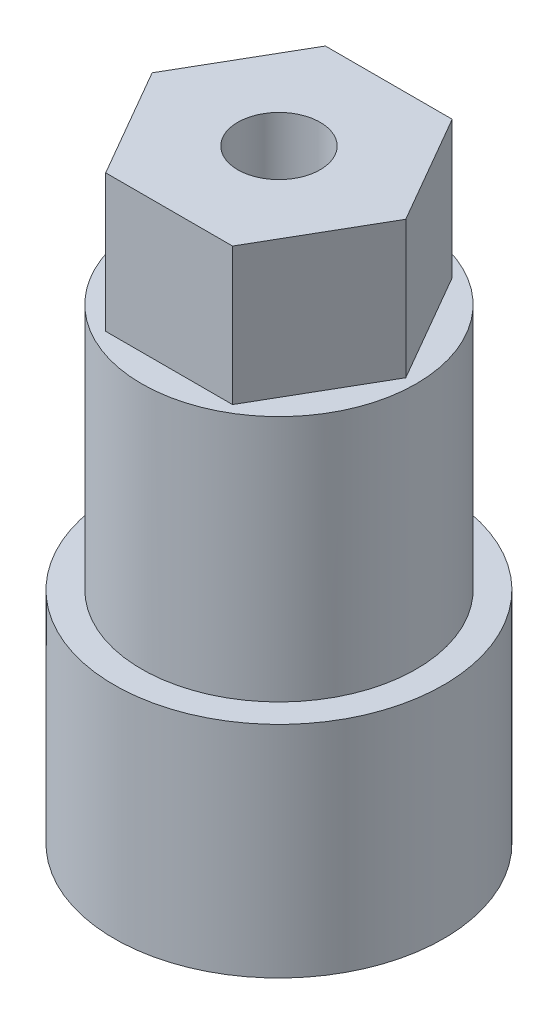
ISO-10303-21;
HEADER;
FILE_DESCRIPTION(('STEP AP214'),'2;1');
FILE_NAME('part.step','',(''),(''),'','','');
FILE_SCHEMA(('AUTOMOTIVE_DESIGN { 1 0 10303 214 1 1 1 1 }'));
ENDSEC;
DATA;
#1=APPLICATION_CONTEXT('core data for automotive mechanical design processes');
#2=APPLICATION_PROTOCOL_DEFINITION('international standard','automotive_design',2000,#1);
#3=PRODUCT_CONTEXT('',#1,'mechanical');
#4=PRODUCT('Part','Part','',(#3));
#5=PRODUCT_RELATED_PRODUCT_CATEGORY('part','',(#4));
#6=PRODUCT_DEFINITION_FORMATION('','',#4);
#7=PRODUCT_DEFINITION_CONTEXT('part definition',#1,'design');
#8=PRODUCT_DEFINITION('design','',#6,#7);
#9=PRODUCT_DEFINITION_SHAPE('','',#8);
#10=(LENGTH_UNIT() NAMED_UNIT(*) SI_UNIT(.MILLI.,.METRE.));
#11=(NAMED_UNIT(*) PLANE_ANGLE_UNIT() SI_UNIT($,.RADIAN.));
#12=(NAMED_UNIT(*) SI_UNIT($,.STERADIAN.) SOLID_ANGLE_UNIT());
#13=UNCERTAINTY_MEASURE_WITH_UNIT(LENGTH_MEASURE(1.E-05),#10,'distance_accuracy_value','');
#14=(GEOMETRIC_REPRESENTATION_CONTEXT(3) GLOBAL_UNCERTAINTY_ASSIGNED_CONTEXT((#13)) GLOBAL_UNIT_ASSIGNED_CONTEXT((#10,
#11,#12)) REPRESENTATION_CONTEXT('',''));
#15=CARTESIAN_POINT('',(0.,0.,0.));
#16=DIRECTION('',(0.,0.,1.));
#17=DIRECTION('',(1.,0.,0.));
#18=AXIS2_PLACEMENT_3D('',#15,#16,#17);
#19=CARTESIAN_POINT('',(0.,9.,0.));
#20=DIRECTION('',(0.,1.,0.));
#21=DIRECTION('',(0.,0.,1.));
#22=AXIS2_PLACEMENT_3D('',#19,#20,#21);
#23=PLANE('',#22);
#24=CARTESIAN_POINT('',(0.,9.,0.));
#25=DIRECTION('',(0.,1.,0.));
#26=DIRECTION('',(0.,0.,1.));
#27=AXIS2_PLACEMENT_3D('',#24,#25,#26);
#28=CIRCLE('',#27,5.);
#29=CARTESIAN_POINT('',(0.,9.,5.));
#30=VERTEX_POINT('',#29);
#31=EDGE_CURVE('E11',#30,#30,#28,.T.);
#32=ORIENTED_EDGE('',*,*,#31,.T.);
#33=EDGE_LOOP('',(#32));
#34=FACE_BOUND('',#33,.T.);
#35=DIRECTION('',(-0.5,0.,-0.866025403784439));
#36=VECTOR('',#35,1.);
#37=CARTESIAN_POINT('',(4.61880215351701,9.,0.));
#38=LINE('',#37,#36);
#39=CARTESIAN_POINT('',(4.61880215351701,9.,0.));
#40=VERTEX_POINT('',#39);
#41=CARTESIAN_POINT('',(2.3094010767585,9.,-4.));
#42=VERTEX_POINT('',#41);
#43=EDGE_CURVE('E122',#40,#42,#38,.T.);
#44=ORIENTED_EDGE('',*,*,#43,.F.);
#45=DIRECTION('',(0.5,0.,-0.866025403784439));
#46=VECTOR('',#45,1.);
#47=CARTESIAN_POINT('',(2.3094010767585,9.,4.));
#48=LINE('',#47,#46);
#49=CARTESIAN_POINT('',(2.3094010767585,9.,4.));
#50=VERTEX_POINT('',#49);
#51=EDGE_CURVE('E119',#50,#40,#48,.T.);
#52=ORIENTED_EDGE('',*,*,#51,.F.);
#53=DIRECTION('',(1.,0.,0.));
#54=VECTOR('',#53,1.);
#55=CARTESIAN_POINT('',(-2.3094010767585,9.,4.));
#56=LINE('',#55,#54);
#57=CARTESIAN_POINT('',(-2.3094010767585,9.,4.));
#58=VERTEX_POINT('',#57);
#59=EDGE_CURVE('E78',#58,#50,#56,.T.);
#60=ORIENTED_EDGE('',*,*,#59,.F.);
#61=DIRECTION('',(0.5,0.,0.866025403784439));
#62=VECTOR('',#61,1.);
#63=CARTESIAN_POINT('',(-4.61880215351701,9.,0.));
#64=LINE('',#63,#62);
#65=CARTESIAN_POINT('',(-4.61880215351701,9.,0.));
#66=VERTEX_POINT('',#65);
#67=EDGE_CURVE('E128',#66,#58,#64,.T.);
#68=ORIENTED_EDGE('',*,*,#67,.F.);
#69=DIRECTION('',(-0.5,0.,0.866025403784439));
#70=VECTOR('',#69,1.);
#71=CARTESIAN_POINT('',(-2.3094010767585,9.,-4.));
#72=LINE('',#71,#70);
#73=CARTESIAN_POINT('',(-2.3094010767585,9.,-4.));
#74=VERTEX_POINT('',#73);
#75=EDGE_CURVE('E108',#74,#66,#72,.T.);
#76=ORIENTED_EDGE('',*,*,#75,.F.);
#77=DIRECTION('',(-1.,0.,0.));
#78=VECTOR('',#77,1.);
#79=CARTESIAN_POINT('',(2.3094010767585,9.,-4.));
#80=LINE('',#79,#78);
#81=EDGE_CURVE('E125',#42,#74,#80,.T.);
#82=ORIENTED_EDGE('',*,*,#81,.F.);
#83=EDGE_LOOP('',(#44,#52,#60,#68,#76,#82));
#84=FACE_BOUND('',#83,.T.);
#85=ADVANCED_FACE('F35',(#34,#84),#23,.T.);
#86=CARTESIAN_POINT('',(0.,9.,0.));
#87=DIRECTION('',(0.,-1.,0.));
#88=DIRECTION('',(0.,0.,-1.));
#89=AXIS2_PLACEMENT_3D('',#86,#87,#88);
#90=CYLINDRICAL_SURFACE('',#89,5.);
#91=ORIENTED_EDGE('',*,*,#31,.F.);
#92=EDGE_LOOP('',(#91));
#93=FACE_BOUND('',#92,.T.);
#94=CARTESIAN_POINT('',(0.,0.,0.));
#95=DIRECTION('',(0.,-1.,0.));
#96=DIRECTION('',(0.,0.,-1.));
#97=AXIS2_PLACEMENT_3D('',#94,#95,#96);
#98=CIRCLE('',#97,5.);
#99=CARTESIAN_POINT('',(0.,0.,-5.));
#100=VERTEX_POINT('',#99);
#101=EDGE_CURVE('E43',#100,#100,#98,.T.);
#102=ORIENTED_EDGE('',*,*,#101,.F.);
#103=EDGE_LOOP('',(#102));
#104=FACE_BOUND('',#103,.T.);
#105=ADVANCED_FACE('F37',(#93,#104),#90,.T.);
#106=CARTESIAN_POINT('',(0.,0.,0.));
#107=DIRECTION('',(0.,-1.,0.));
#108=DIRECTION('',(0.,0.,-1.));
#109=AXIS2_PLACEMENT_3D('',#106,#107,#108);
#110=PLANE('',#109);
#111=CARTESIAN_POINT('',(0.,0.,0.));
#112=DIRECTION('',(0.,-1.,0.));
#113=DIRECTION('',(0.,0.,-1.));
#114=AXIS2_PLACEMENT_3D('',#111,#112,#113);
#115=CIRCLE('',#114,6.);
#116=CARTESIAN_POINT('',(0.,0.,-6.));
#117=VERTEX_POINT('',#116);
#118=EDGE_CURVE('E140',#117,#117,#115,.T.);
#119=ORIENTED_EDGE('',*,*,#118,.F.);
#120=EDGE_LOOP('',(#119));
#121=FACE_BOUND('',#120,.T.);
#122=ORIENTED_EDGE('',*,*,#101,.T.);
#123=EDGE_LOOP('',(#122));
#124=FACE_BOUND('',#123,.T.);
#125=ADVANCED_FACE('F148',(#121,#124),#110,.F.);
#126=CARTESIAN_POINT('',(0.,-8.,0.));
#127=DIRECTION('',(0.,1.,0.));
#128=DIRECTION('',(0.,0.,1.));
#129=AXIS2_PLACEMENT_3D('',#126,#127,#128);
#130=CYLINDRICAL_SURFACE('',#129,6.);
#131=CARTESIAN_POINT('',(0.,-8.,0.));
#132=DIRECTION('',(0.,-1.,0.));
#133=DIRECTION('',(0.,0.,-1.));
#134=AXIS2_PLACEMENT_3D('',#131,#132,#133);
#135=CIRCLE('',#134,6.);
#136=CARTESIAN_POINT('',(0.,-8.,-6.));
#137=VERTEX_POINT('',#136);
#138=EDGE_CURVE('E141',#137,#137,#135,.T.);
#139=ORIENTED_EDGE('',*,*,#138,.F.);
#140=EDGE_LOOP('',(#139));
#141=FACE_BOUND('',#140,.T.);
#142=ORIENTED_EDGE('',*,*,#118,.T.);
#143=EDGE_LOOP('',(#142));
#144=FACE_BOUND('',#143,.T.);
#145=ADVANCED_FACE('F156',(#141,#144),#130,.T.);
#146=CARTESIAN_POINT('',(0.,-8.,0.));
#147=DIRECTION('',(0.,-1.,0.));
#148=DIRECTION('',(0.,0.,-1.));
#149=AXIS2_PLACEMENT_3D('',#146,#147,#148);
#150=PLANE('',#149);
#151=ORIENTED_EDGE('',*,*,#138,.T.);
#152=EDGE_LOOP('',(#151));
#153=FACE_BOUND('',#152,.T.);
#154=ADVANCED_FACE('F206',(#153),#150,.T.);
#155=CARTESIAN_POINT('',(2.3094010767585,14.,4.));
#156=DIRECTION('',(-0.866025403784439,0.,-0.5));
#157=DIRECTION('',(-0.5,0.,0.866025403784439));
#158=AXIS2_PLACEMENT_3D('',#155,#156,#157);
#159=PLANE('',#158);
#160=ORIENTED_EDGE('',*,*,#51,.T.);
#161=DIRECTION('',(0.,-1.,0.));
#162=VECTOR('',#161,1.);
#163=CARTESIAN_POINT('',(4.61880215351701,14.,0.));
#164=LINE('',#163,#162);
#165=CARTESIAN_POINT('',(4.61880215351701,14.,0.));
#166=VERTEX_POINT('',#165);
#167=EDGE_CURVE('E138',#166,#40,#164,.T.);
#168=ORIENTED_EDGE('',*,*,#167,.F.);
#169=DIRECTION('',(0.5,0.,-0.866025403784439));
#170=VECTOR('',#169,1.);
#171=CARTESIAN_POINT('',(2.3094010767585,14.,4.));
#172=LINE('',#171,#170);
#173=CARTESIAN_POINT('',(2.3094010767585,14.,4.));
#174=VERTEX_POINT('',#173);
#175=EDGE_CURVE('E131',#174,#166,#172,.T.);
#176=ORIENTED_EDGE('',*,*,#175,.F.);
#177=DIRECTION('',(0.,-1.,0.));
#178=VECTOR('',#177,1.);
#179=CARTESIAN_POINT('',(2.3094010767585,14.,4.));
#180=LINE('',#179,#178);
#181=EDGE_CURVE('E115',#174,#50,#180,.T.);
#182=ORIENTED_EDGE('',*,*,#181,.T.);
#183=EDGE_LOOP('',(#160,#168,#176,#182));
#184=FACE_BOUND('',#183,.T.);
#185=ADVANCED_FACE('F203',(#184),#159,.F.);
#186=CARTESIAN_POINT('',(4.61880215351701,14.,0.));
#187=DIRECTION('',(-0.866025403784439,0.,0.5));
#188=DIRECTION('',(0.5,0.,0.866025403784439));
#189=AXIS2_PLACEMENT_3D('',#186,#187,#188);
#190=PLANE('',#189);
#191=ORIENTED_EDGE('',*,*,#43,.T.);
#192=DIRECTION('',(0.,-1.,0.));
#193=VECTOR('',#192,1.);
#194=CARTESIAN_POINT('',(2.3094010767585,14.,-4.));
#195=LINE('',#194,#193);
#196=CARTESIAN_POINT('',(2.3094010767585,14.,-4.));
#197=VERTEX_POINT('',#196);
#198=EDGE_CURVE('E135',#197,#42,#195,.T.);
#199=ORIENTED_EDGE('',*,*,#198,.F.);
#200=DIRECTION('',(-0.5,0.,-0.866025403784439));
#201=VECTOR('',#200,1.);
#202=CARTESIAN_POINT('',(4.61880215351701,14.,0.));
#203=LINE('',#202,#201);
#204=EDGE_CURVE('E86',#166,#197,#203,.T.);
#205=ORIENTED_EDGE('',*,*,#204,.F.);
#206=ORIENTED_EDGE('',*,*,#167,.T.);
#207=EDGE_LOOP('',(#191,#199,#205,#206));
#208=FACE_BOUND('',#207,.T.);
#209=ADVANCED_FACE('F165',(#208),#190,.F.);
#210=CARTESIAN_POINT('',(2.3094010767585,14.,-4.));
#211=DIRECTION('',(0.,0.,1.));
#212=DIRECTION('',(1.,0.,0.));
#213=AXIS2_PLACEMENT_3D('',#210,#211,#212);
#214=PLANE('',#213);
#215=ORIENTED_EDGE('',*,*,#81,.T.);
#216=DIRECTION('',(0.,-1.,0.));
#217=VECTOR('',#216,1.);
#218=CARTESIAN_POINT('',(-2.3094010767585,14.,-4.));
#219=LINE('',#218,#217);
#220=CARTESIAN_POINT('',(-2.3094010767585,14.,-4.));
#221=VERTEX_POINT('',#220);
#222=EDGE_CURVE('E111',#221,#74,#219,.T.);
#223=ORIENTED_EDGE('',*,*,#222,.F.);
#224=DIRECTION('',(-1.,0.,0.));
#225=VECTOR('',#224,1.);
#226=CARTESIAN_POINT('',(2.3094010767585,14.,-4.));
#227=LINE('',#226,#225);
#228=EDGE_CURVE('E99',#197,#221,#227,.T.);
#229=ORIENTED_EDGE('',*,*,#228,.F.);
#230=ORIENTED_EDGE('',*,*,#198,.T.);
#231=EDGE_LOOP('',(#215,#223,#229,#230));
#232=FACE_BOUND('',#231,.T.);
#233=ADVANCED_FACE('F168',(#232),#214,.F.);
#234=CARTESIAN_POINT('',(-2.3094010767585,14.,-4.));
#235=DIRECTION('',(0.866025403784439,0.,0.5));
#236=DIRECTION('',(0.5,0.,-0.866025403784439));
#237=AXIS2_PLACEMENT_3D('',#234,#235,#236);
#238=PLANE('',#237);
#239=ORIENTED_EDGE('',*,*,#75,.T.);
#240=DIRECTION('',(0.,-1.,0.));
#241=VECTOR('',#240,1.);
#242=CARTESIAN_POINT('',(-4.61880215351701,14.,0.));
#243=LINE('',#242,#241);
#244=CARTESIAN_POINT('',(-4.61880215351701,14.,0.));
#245=VERTEX_POINT('',#244);
#246=EDGE_CURVE('E105',#245,#66,#243,.T.);
#247=ORIENTED_EDGE('',*,*,#246,.F.);
#248=DIRECTION('',(-0.5,0.,0.866025403784439));
#249=VECTOR('',#248,1.);
#250=CARTESIAN_POINT('',(-2.3094010767585,14.,-4.));
#251=LINE('',#250,#249);
#252=EDGE_CURVE('E93',#221,#245,#251,.T.);
#253=ORIENTED_EDGE('',*,*,#252,.F.);
#254=ORIENTED_EDGE('',*,*,#222,.T.);
#255=EDGE_LOOP('',(#239,#247,#253,#254));
#256=FACE_BOUND('',#255,.T.);
#257=ADVANCED_FACE('F106',(#256),#238,.F.);
#258=CARTESIAN_POINT('',(-4.61880215351701,14.,0.));
#259=DIRECTION('',(0.866025403784439,0.,-0.5));
#260=DIRECTION('',(-0.5,0.,-0.866025403784439));
#261=AXIS2_PLACEMENT_3D('',#258,#259,#260);
#262=PLANE('',#261);
#263=ORIENTED_EDGE('',*,*,#67,.T.);
#264=DIRECTION('',(0.,-1.,0.));
#265=VECTOR('',#264,1.);
#266=CARTESIAN_POINT('',(-2.3094010767585,14.,4.));
#267=LINE('',#266,#265);
#268=CARTESIAN_POINT('',(-2.3094010767585,14.,4.));
#269=VERTEX_POINT('',#268);
#270=EDGE_CURVE('E50',#269,#58,#267,.T.);
#271=ORIENTED_EDGE('',*,*,#270,.F.);
#272=DIRECTION('',(0.5,0.,0.866025403784439));
#273=VECTOR('',#272,1.);
#274=CARTESIAN_POINT('',(-4.61880215351701,14.,0.));
#275=LINE('',#274,#273);
#276=EDGE_CURVE('E97',#245,#269,#275,.T.);
#277=ORIENTED_EDGE('',*,*,#276,.F.);
#278=ORIENTED_EDGE('',*,*,#246,.T.);
#279=EDGE_LOOP('',(#263,#271,#277,#278));
#280=FACE_BOUND('',#279,.T.);
#281=ADVANCED_FACE('F113',(#280),#262,.F.);
#282=CARTESIAN_POINT('',(-2.3094010767585,14.,4.));
#283=DIRECTION('',(0.,0.,-1.));
#284=DIRECTION('',(-1.,0.,0.));
#285=AXIS2_PLACEMENT_3D('',#282,#283,#284);
#286=PLANE('',#285);
#287=ORIENTED_EDGE('',*,*,#59,.T.);
#288=ORIENTED_EDGE('',*,*,#181,.F.);
#289=DIRECTION('',(1.,0.,0.));
#290=VECTOR('',#289,1.);
#291=CARTESIAN_POINT('',(-2.3094010767585,14.,4.));
#292=LINE('',#291,#290);
#293=EDGE_CURVE('E58',#269,#174,#292,.T.);
#294=ORIENTED_EDGE('',*,*,#293,.F.);
#295=ORIENTED_EDGE('',*,*,#270,.T.);
#296=EDGE_LOOP('',(#287,#288,#294,#295));
#297=FACE_BOUND('',#296,.T.);
#298=ADVANCED_FACE('F187',(#297),#286,.F.);
#299=CARTESIAN_POINT('',(0.,14.,0.));
#300=DIRECTION('',(0.,1.,0.));
#301=DIRECTION('',(0.,0.,1.));
#302=AXIS2_PLACEMENT_3D('',#299,#300,#301);
#303=PLANE('',#302);
#304=CARTESIAN_POINT('',(0.,14.,0.));
#305=DIRECTION('',(0.,1.,0.));
#306=DIRECTION('',(0.,0.,1.));
#307=AXIS2_PLACEMENT_3D('',#304,#305,#306);
#308=CIRCLE('',#307,1.5);
#309=CARTESIAN_POINT('',(0.,14.,1.5));
#310=VERTEX_POINT('',#309);
#311=EDGE_CURVE('E172',#310,#310,#308,.T.);
#312=ORIENTED_EDGE('',*,*,#311,.F.);
#313=EDGE_LOOP('',(#312));
#314=FACE_BOUND('',#313,.T.);
#315=ORIENTED_EDGE('',*,*,#175,.T.);
#316=ORIENTED_EDGE('',*,*,#204,.T.);
#317=ORIENTED_EDGE('',*,*,#228,.T.);
#318=ORIENTED_EDGE('',*,*,#252,.T.);
#319=ORIENTED_EDGE('',*,*,#276,.T.);
#320=ORIENTED_EDGE('',*,*,#293,.T.);
#321=EDGE_LOOP('',(#315,#316,#317,#318,#319,#320));
#322=FACE_BOUND('',#321,.T.);
#323=ADVANCED_FACE('F95',(#314,#322),#303,.T.);
#324=CARTESIAN_POINT('',(0.,2.,0.));
#325=DIRECTION('',(0.,1.,0.));
#326=DIRECTION('',(0.,0.,1.));
#327=AXIS2_PLACEMENT_3D('',#324,#325,#326);
#328=CYLINDRICAL_SURFACE('',#327,1.5);
#329=CARTESIAN_POINT('',(0.,2.,0.));
#330=DIRECTION('',(0.,1.,0.));
#331=DIRECTION('',(0.,0.,1.));
#332=AXIS2_PLACEMENT_3D('',#329,#330,#331);
#333=CIRCLE('',#332,1.5);
#334=CARTESIAN_POINT('',(0.,2.,1.5));
#335=VERTEX_POINT('',#334);
#336=EDGE_CURVE('E123',#335,#335,#333,.T.);
#337=ORIENTED_EDGE('',*,*,#336,.F.);
#338=EDGE_LOOP('',(#337));
#339=FACE_BOUND('',#338,.T.);
#340=ORIENTED_EDGE('',*,*,#311,.T.);
#341=EDGE_LOOP('',(#340));
#342=FACE_BOUND('',#341,.T.);
#343=ADVANCED_FACE('F180',(#339,#342),#328,.F.);
#344=CARTESIAN_POINT('',(0.,2.,0.));
#345=DIRECTION('',(0.,1.,0.));
#346=DIRECTION('',(0.,0.,1.));
#347=AXIS2_PLACEMENT_3D('',#344,#345,#346);
#348=PLANE('',#347);
#349=ORIENTED_EDGE('',*,*,#336,.T.);
#350=EDGE_LOOP('',(#349));
#351=FACE_BOUND('',#350,.T.);
#352=ADVANCED_FACE('F178',(#351),#348,.T.);
#353=CLOSED_SHELL('',(#85,#105,#125,#145,#154,#185,#209,#233,#257,#281,#298,#323,#343,#352));
#354=MANIFOLD_SOLID_BREP('B2',#353);
#355=ADVANCED_BREP_SHAPE_REPRESENTATION('',(#18,#354),#14);
#356=SHAPE_DEFINITION_REPRESENTATION(#9,#355);
ENDSEC;
END-ISO-10303-21;
